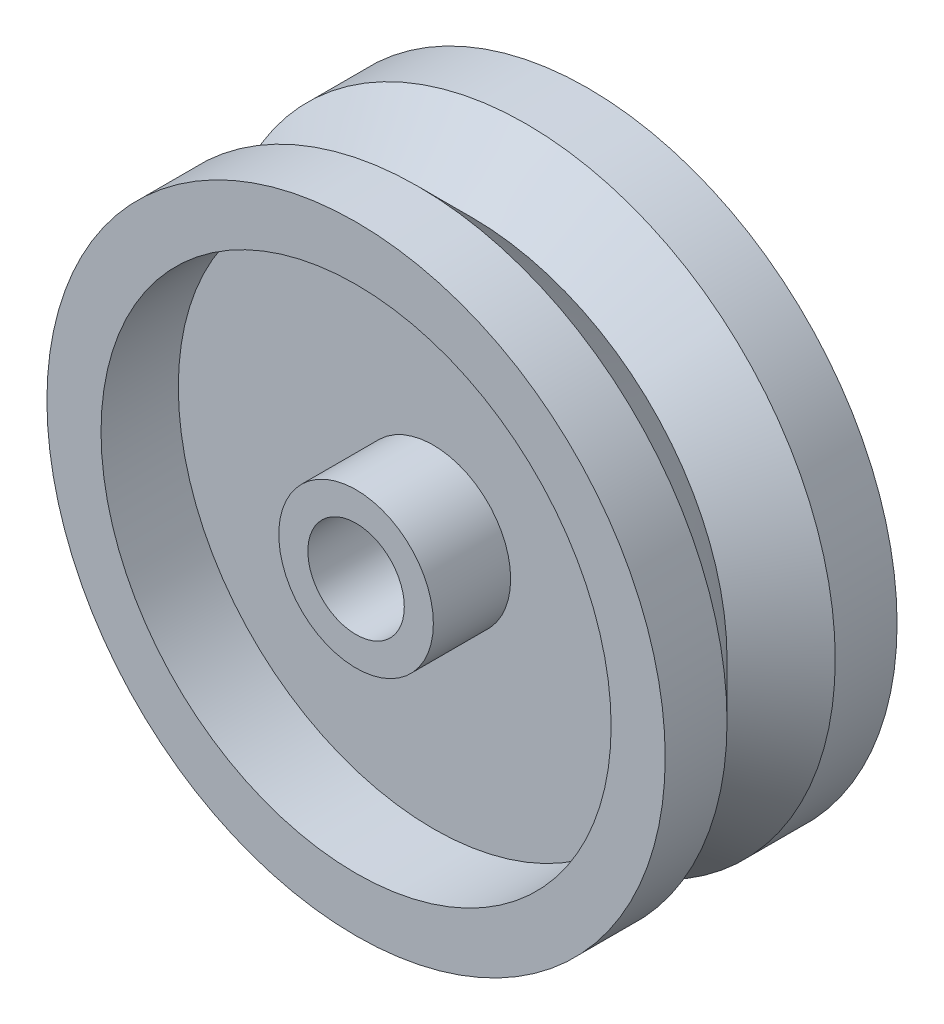
ISO-10303-21;
HEADER;
FILE_DESCRIPTION(('STEP AP214'),'2;1');
FILE_NAME('part.step','',(''),(''),'','','');
FILE_SCHEMA(('AUTOMOTIVE_DESIGN { 1 0 10303 214 1 1 1 1 }'));
ENDSEC;
DATA;
#1=APPLICATION_CONTEXT('core data for automotive mechanical design processes');
#2=APPLICATION_PROTOCOL_DEFINITION('international standard','automotive_design',2000,#1);
#3=PRODUCT_CONTEXT('',#1,'mechanical');
#4=PRODUCT('Part','Part','',(#3));
#5=PRODUCT_RELATED_PRODUCT_CATEGORY('part','',(#4));
#6=PRODUCT_DEFINITION_FORMATION('','',#4);
#7=PRODUCT_DEFINITION_CONTEXT('part definition',#1,'design');
#8=PRODUCT_DEFINITION('design','',#6,#7);
#9=PRODUCT_DEFINITION_SHAPE('','',#8);
#10=(LENGTH_UNIT() NAMED_UNIT(*) SI_UNIT(.MILLI.,.METRE.));
#11=(NAMED_UNIT(*) PLANE_ANGLE_UNIT() SI_UNIT($,.RADIAN.));
#12=(NAMED_UNIT(*) SI_UNIT($,.STERADIAN.) SOLID_ANGLE_UNIT());
#13=UNCERTAINTY_MEASURE_WITH_UNIT(LENGTH_MEASURE(1.E-05),#10,'distance_accuracy_value','');
#14=(GEOMETRIC_REPRESENTATION_CONTEXT(3) GLOBAL_UNCERTAINTY_ASSIGNED_CONTEXT((#13)) GLOBAL_UNIT_ASSIGNED_CONTEXT((#10,
#11,#12)) REPRESENTATION_CONTEXT('',''));
#15=CARTESIAN_POINT('',(0.,0.,0.));
#16=DIRECTION('',(0.,0.,1.));
#17=DIRECTION('',(1.,0.,0.));
#18=AXIS2_PLACEMENT_3D('',#15,#16,#17);
#19=CARTESIAN_POINT('',(0.,3.5,0.));
#20=DIRECTION('',(0.,0.,1.));
#21=DIRECTION('',(1.,0.,0.));
#22=AXIS2_PLACEMENT_3D('',#19,#20,#21);
#23=PLANE('',#22);
#24=CARTESIAN_POINT('',(0.,20.,0.));
#25=DIRECTION('',(0.,0.,1.));
#26=DIRECTION('',(1.,0.,0.));
#27=AXIS2_PLACEMENT_3D('',#24,#25,#26);
#28=CIRCLE('',#27,20.);
#29=CARTESIAN_POINT('',(20.,20.,0.));
#30=VERTEX_POINT('',#29);
#31=EDGE_CURVE('E10',#30,#30,#28,.T.);
#32=ORIENTED_EDGE('',*,*,#31,.T.);
#33=EDGE_LOOP('',(#32));
#34=FACE_BOUND('',#33,.T.);
#35=CARTESIAN_POINT('',(0.,20.,0.));
#36=DIRECTION('',(0.,0.,1.));
#37=DIRECTION('',(1.,0.,0.));
#38=AXIS2_PLACEMENT_3D('',#35,#36,#37);
#39=CIRCLE('',#38,16.5);
#40=CARTESIAN_POINT('',(16.5,20.,0.));
#41=VERTEX_POINT('',#40);
#42=EDGE_CURVE('E84',#41,#41,#39,.T.);
#43=ORIENTED_EDGE('',*,*,#42,.F.);
#44=EDGE_LOOP('',(#43));
#45=FACE_BOUND('',#44,.T.);
#46=ADVANCED_FACE('F35',(#34,#45),#23,.T.);
#47=CARTESIAN_POINT('',(0.,20.,8.78152224866132));
#48=DIRECTION('',(0.,0.,1.));
#49=DIRECTION('',(1.,0.,0.));
#50=AXIS2_PLACEMENT_3D('',#47,#48,#49);
#51=CYLINDRICAL_SURFACE('',#50,20.);
#52=CARTESIAN_POINT('',(0.,20.,-4.00000000000002));
#53=DIRECTION('',(0.,0.,1.));
#54=DIRECTION('',(1.,0.,0.));
#55=AXIS2_PLACEMENT_3D('',#52,#53,#54);
#56=CIRCLE('',#55,20.);
#57=CARTESIAN_POINT('',(20.,20.,-4.00000000000002));
#58=VERTEX_POINT('',#57);
#59=EDGE_CURVE('E41',#58,#58,#56,.T.);
#60=ORIENTED_EDGE('',*,*,#59,.T.);
#61=EDGE_LOOP('',(#60));
#62=FACE_BOUND('',#61,.T.);
#63=ORIENTED_EDGE('',*,*,#31,.F.);
#64=EDGE_LOOP('',(#63));
#65=FACE_BOUND('',#64,.T.);
#66=ADVANCED_FACE('F92',(#62,#65),#51,.T.);
#67=CARTESIAN_POINT('',(0.,20.,-4.00000000000002));
#68=DIRECTION('',(0.,0.,1.));
#69=DIRECTION('',(1.,0.,0.));
#70=AXIS2_PLACEMENT_3D('',#67,#68,#69);
#71=CONICAL_SURFACE('',#70,20.,0.78539816339745);
#72=CARTESIAN_POINT('',(0.,20.,-7.5));
#73=DIRECTION('',(0.,0.,1.));
#74=DIRECTION('',(1.,0.,0.));
#75=AXIS2_PLACEMENT_3D('',#72,#73,#74);
#76=CIRCLE('',#75,16.5);
#77=CARTESIAN_POINT('',(16.5,20.,-7.5));
#78=VERTEX_POINT('',#77);
#79=EDGE_CURVE('E45',#78,#78,#76,.T.);
#80=ORIENTED_EDGE('',*,*,#79,.T.);
#81=EDGE_LOOP('',(#80));
#82=FACE_BOUND('',#81,.T.);
#83=ORIENTED_EDGE('',*,*,#59,.F.);
#84=EDGE_LOOP('',(#83));
#85=FACE_BOUND('',#84,.T.);
#86=ADVANCED_FACE('F96',(#82,#85),#71,.T.);
#87=CARTESIAN_POINT('',(0.,20.,-7.5));
#88=DIRECTION('',(0.,0.,-1.));
#89=DIRECTION('',(-1.,0.,0.));
#90=AXIS2_PLACEMENT_3D('',#87,#88,#89);
#91=CONICAL_SURFACE('',#90,16.5,0.78539816339745);
#92=CARTESIAN_POINT('',(0.,20.,-11.));
#93=DIRECTION('',(0.,0.,1.));
#94=DIRECTION('',(1.,0.,0.));
#95=AXIS2_PLACEMENT_3D('',#92,#93,#94);
#96=CIRCLE('',#95,20.);
#97=CARTESIAN_POINT('',(20.,20.,-11.));
#98=VERTEX_POINT('',#97);
#99=EDGE_CURVE('E49',#98,#98,#96,.T.);
#100=ORIENTED_EDGE('',*,*,#99,.T.);
#101=EDGE_LOOP('',(#100));
#102=FACE_BOUND('',#101,.T.);
#103=ORIENTED_EDGE('',*,*,#79,.F.);
#104=EDGE_LOOP('',(#103));
#105=FACE_BOUND('',#104,.T.);
#106=ADVANCED_FACE('F100',(#102,#105),#91,.T.);
#107=CARTESIAN_POINT('',(0.,20.,8.78152224866132));
#108=DIRECTION('',(0.,0.,1.));
#109=DIRECTION('',(1.,0.,0.));
#110=AXIS2_PLACEMENT_3D('',#107,#108,#109);
#111=CYLINDRICAL_SURFACE('',#110,20.);
#112=CARTESIAN_POINT('',(0.,20.,-15.));
#113=DIRECTION('',(0.,0.,1.));
#114=DIRECTION('',(1.,0.,0.));
#115=AXIS2_PLACEMENT_3D('',#112,#113,#114);
#116=CIRCLE('',#115,20.);
#117=CARTESIAN_POINT('',(20.,20.,-15.));
#118=VERTEX_POINT('',#117);
#119=EDGE_CURVE('E54',#118,#118,#116,.T.);
#120=ORIENTED_EDGE('',*,*,#119,.T.);
#121=EDGE_LOOP('',(#120));
#122=FACE_BOUND('',#121,.T.);
#123=ORIENTED_EDGE('',*,*,#99,.F.);
#124=EDGE_LOOP('',(#123));
#125=FACE_BOUND('',#124,.T.);
#126=ADVANCED_FACE('F107',(#122,#125),#111,.T.);
#127=CARTESIAN_POINT('',(0.,3.5,-15.));
#128=DIRECTION('',(0.,0.,-1.));
#129=DIRECTION('',(-1.,0.,0.));
#130=AXIS2_PLACEMENT_3D('',#127,#128,#129);
#131=PLANE('',#130);
#132=CARTESIAN_POINT('',(0.,20.,-15.));
#133=DIRECTION('',(0.,0.,1.));
#134=DIRECTION('',(1.,0.,0.));
#135=AXIS2_PLACEMENT_3D('',#132,#133,#134);
#136=CIRCLE('',#135,16.5);
#137=CARTESIAN_POINT('',(16.5,20.,-15.));
#138=VERTEX_POINT('',#137);
#139=EDGE_CURVE('E57',#138,#138,#136,.T.);
#140=ORIENTED_EDGE('',*,*,#139,.T.);
#141=EDGE_LOOP('',(#140));
#142=FACE_BOUND('',#141,.T.);
#143=ORIENTED_EDGE('',*,*,#119,.F.);
#144=EDGE_LOOP('',(#143));
#145=FACE_BOUND('',#144,.T.);
#146=ADVANCED_FACE('F111',(#142,#145),#131,.T.);
#147=CARTESIAN_POINT('',(0.,20.,8.78152224866132));
#148=DIRECTION('',(0.,0.,1.));
#149=DIRECTION('',(1.,0.,0.));
#150=AXIS2_PLACEMENT_3D('',#147,#148,#149);
#151=CYLINDRICAL_SURFACE('',#150,16.5);
#152=CARTESIAN_POINT('',(0.,20.,-10.));
#153=DIRECTION('',(0.,0.,1.));
#154=DIRECTION('',(1.,0.,0.));
#155=AXIS2_PLACEMENT_3D('',#152,#153,#154);
#156=CIRCLE('',#155,16.5);
#157=CARTESIAN_POINT('',(16.5,20.,-10.));
#158=VERTEX_POINT('',#157);
#159=EDGE_CURVE('E60',#158,#158,#156,.T.);
#160=ORIENTED_EDGE('',*,*,#159,.T.);
#161=EDGE_LOOP('',(#160));
#162=FACE_BOUND('',#161,.T.);
#163=ORIENTED_EDGE('',*,*,#139,.F.);
#164=EDGE_LOOP('',(#163));
#165=FACE_BOUND('',#164,.T.);
#166=ADVANCED_FACE('F115',(#162,#165),#151,.F.);
#167=CARTESIAN_POINT('',(0.,3.5,-10.));
#168=DIRECTION('',(0.,0.,-1.));
#169=DIRECTION('',(-1.,0.,0.));
#170=AXIS2_PLACEMENT_3D('',#167,#168,#169);
#171=PLANE('',#170);
#172=CARTESIAN_POINT('',(0.,20.,-10.));
#173=DIRECTION('',(0.,0.,1.));
#174=DIRECTION('',(1.,0.,0.));
#175=AXIS2_PLACEMENT_3D('',#172,#173,#174);
#176=CIRCLE('',#175,5.);
#177=CARTESIAN_POINT('',(5.,20.,-10.));
#178=VERTEX_POINT('',#177);
#179=EDGE_CURVE('E63',#178,#178,#176,.T.);
#180=ORIENTED_EDGE('',*,*,#179,.T.);
#181=EDGE_LOOP('',(#180));
#182=FACE_BOUND('',#181,.T.);
#183=ORIENTED_EDGE('',*,*,#159,.F.);
#184=EDGE_LOOP('',(#183));
#185=FACE_BOUND('',#184,.T.);
#186=ADVANCED_FACE('F119',(#182,#185),#171,.T.);
#187=CARTESIAN_POINT('',(0.,20.,8.78152224866132));
#188=DIRECTION('',(0.,0.,1.));
#189=DIRECTION('',(1.,0.,0.));
#190=AXIS2_PLACEMENT_3D('',#187,#188,#189);
#191=CYLINDRICAL_SURFACE('',#190,5.);
#192=CARTESIAN_POINT('',(0.,20.,-15.));
#193=DIRECTION('',(0.,0.,1.));
#194=DIRECTION('',(1.,0.,0.));
#195=AXIS2_PLACEMENT_3D('',#192,#193,#194);
#196=CIRCLE('',#195,5.);
#197=CARTESIAN_POINT('',(5.,20.,-15.));
#198=VERTEX_POINT('',#197);
#199=EDGE_CURVE('E66',#198,#198,#196,.T.);
#200=ORIENTED_EDGE('',*,*,#199,.T.);
#201=EDGE_LOOP('',(#200));
#202=FACE_BOUND('',#201,.T.);
#203=ORIENTED_EDGE('',*,*,#179,.F.);
#204=EDGE_LOOP('',(#203));
#205=FACE_BOUND('',#204,.T.);
#206=ADVANCED_FACE('F123',(#202,#205),#191,.T.);
#207=CARTESIAN_POINT('',(0.,16.88,-15.));
#208=DIRECTION('',(0.,0.,-1.));
#209=DIRECTION('',(-1.,0.,0.));
#210=AXIS2_PLACEMENT_3D('',#207,#208,#209);
#211=PLANE('',#210);
#212=CARTESIAN_POINT('',(0.,20.,-15.));
#213=DIRECTION('',(0.,0.,1.));
#214=DIRECTION('',(1.,0.,0.));
#215=AXIS2_PLACEMENT_3D('',#212,#213,#214);
#216=CIRCLE('',#215,3.12);
#217=CARTESIAN_POINT('',(3.12,20.,-15.));
#218=VERTEX_POINT('',#217);
#219=EDGE_CURVE('E69',#218,#218,#216,.T.);
#220=ORIENTED_EDGE('',*,*,#219,.T.);
#221=EDGE_LOOP('',(#220));
#222=FACE_BOUND('',#221,.T.);
#223=ORIENTED_EDGE('',*,*,#199,.F.);
#224=EDGE_LOOP('',(#223));
#225=FACE_BOUND('',#224,.T.);
#226=ADVANCED_FACE('F127',(#222,#225),#211,.T.);
#227=CARTESIAN_POINT('',(0.,20.,8.78152224866132));
#228=DIRECTION('',(0.,0.,1.));
#229=DIRECTION('',(1.,0.,0.));
#230=AXIS2_PLACEMENT_3D('',#227,#228,#229);
#231=CYLINDRICAL_SURFACE('',#230,3.12);
#232=CARTESIAN_POINT('',(0.,20.,0.));
#233=DIRECTION('',(0.,0.,1.));
#234=DIRECTION('',(1.,0.,0.));
#235=AXIS2_PLACEMENT_3D('',#232,#233,#234);
#236=CIRCLE('',#235,3.12);
#237=CARTESIAN_POINT('',(3.12,20.,0.));
#238=VERTEX_POINT('',#237);
#239=EDGE_CURVE('E72',#238,#238,#236,.T.);
#240=ORIENTED_EDGE('',*,*,#239,.T.);
#241=EDGE_LOOP('',(#240));
#242=FACE_BOUND('',#241,.T.);
#243=ORIENTED_EDGE('',*,*,#219,.F.);
#244=EDGE_LOOP('',(#243));
#245=FACE_BOUND('',#244,.T.);
#246=ADVANCED_FACE('F131',(#242,#245),#231,.F.);
#247=CARTESIAN_POINT('',(0.,16.88,0.));
#248=DIRECTION('',(0.,0.,1.));
#249=DIRECTION('',(1.,0.,0.));
#250=AXIS2_PLACEMENT_3D('',#247,#248,#249);
#251=PLANE('',#250);
#252=CARTESIAN_POINT('',(0.,20.,0.));
#253=DIRECTION('',(0.,0.,1.));
#254=DIRECTION('',(1.,0.,0.));
#255=AXIS2_PLACEMENT_3D('',#252,#253,#254);
#256=CIRCLE('',#255,5.);
#257=CARTESIAN_POINT('',(5.,20.,0.));
#258=VERTEX_POINT('',#257);
#259=EDGE_CURVE('E75',#258,#258,#256,.T.);
#260=ORIENTED_EDGE('',*,*,#259,.T.);
#261=EDGE_LOOP('',(#260));
#262=FACE_BOUND('',#261,.T.);
#263=ORIENTED_EDGE('',*,*,#239,.F.);
#264=EDGE_LOOP('',(#263));
#265=FACE_BOUND('',#264,.T.);
#266=ADVANCED_FACE('F135',(#262,#265),#251,.T.);
#267=CARTESIAN_POINT('',(0.,20.,8.78152224866132));
#268=DIRECTION('',(0.,0.,1.));
#269=DIRECTION('',(1.,0.,0.));
#270=AXIS2_PLACEMENT_3D('',#267,#268,#269);
#271=CYLINDRICAL_SURFACE('',#270,5.);
#272=CARTESIAN_POINT('',(0.,20.,-5.));
#273=DIRECTION('',(0.,0.,1.));
#274=DIRECTION('',(1.,0.,0.));
#275=AXIS2_PLACEMENT_3D('',#272,#273,#274);
#276=CIRCLE('',#275,5.);
#277=CARTESIAN_POINT('',(5.,20.,-5.));
#278=VERTEX_POINT('',#277);
#279=EDGE_CURVE('E78',#278,#278,#276,.T.);
#280=ORIENTED_EDGE('',*,*,#279,.T.);
#281=EDGE_LOOP('',(#280));
#282=FACE_BOUND('',#281,.T.);
#283=ORIENTED_EDGE('',*,*,#259,.F.);
#284=EDGE_LOOP('',(#283));
#285=FACE_BOUND('',#284,.T.);
#286=ADVANCED_FACE('F139',(#282,#285),#271,.T.);
#287=CARTESIAN_POINT('',(0.,3.5,-5.));
#288=DIRECTION('',(0.,0.,1.));
#289=DIRECTION('',(1.,0.,0.));
#290=AXIS2_PLACEMENT_3D('',#287,#288,#289);
#291=PLANE('',#290);
#292=CARTESIAN_POINT('',(0.,20.,-5.));
#293=DIRECTION('',(0.,0.,1.));
#294=DIRECTION('',(1.,0.,0.));
#295=AXIS2_PLACEMENT_3D('',#292,#293,#294);
#296=CIRCLE('',#295,16.5);
#297=CARTESIAN_POINT('',(16.5,20.,-5.));
#298=VERTEX_POINT('',#297);
#299=EDGE_CURVE('E81',#298,#298,#296,.T.);
#300=ORIENTED_EDGE('',*,*,#299,.T.);
#301=EDGE_LOOP('',(#300));
#302=FACE_BOUND('',#301,.T.);
#303=ORIENTED_EDGE('',*,*,#279,.F.);
#304=EDGE_LOOP('',(#303));
#305=FACE_BOUND('',#304,.T.);
#306=ADVANCED_FACE('F143',(#302,#305),#291,.T.);
#307=CARTESIAN_POINT('',(0.,20.,8.78152224866132));
#308=DIRECTION('',(0.,0.,1.));
#309=DIRECTION('',(1.,0.,0.));
#310=AXIS2_PLACEMENT_3D('',#307,#308,#309);
#311=CYLINDRICAL_SURFACE('',#310,16.5);
#312=ORIENTED_EDGE('',*,*,#42,.T.);
#313=EDGE_LOOP('',(#312));
#314=FACE_BOUND('',#313,.T.);
#315=ORIENTED_EDGE('',*,*,#299,.F.);
#316=EDGE_LOOP('',(#315));
#317=FACE_BOUND('',#316,.T.);
#318=ADVANCED_FACE('F88',(#314,#317),#311,.F.);
#319=CLOSED_SHELL('',(#46,#66,#86,#106,#126,#146,#166,#186,#206,#226,#246,#266,#286,#306,#318));
#320=MANIFOLD_SOLID_BREP('B2',#319);
#321=ADVANCED_BREP_SHAPE_REPRESENTATION('',(#18,#320),#14);
#322=SHAPE_DEFINITION_REPRESENTATION(#9,#321);
ENDSEC;
END-ISO-10303-21;
